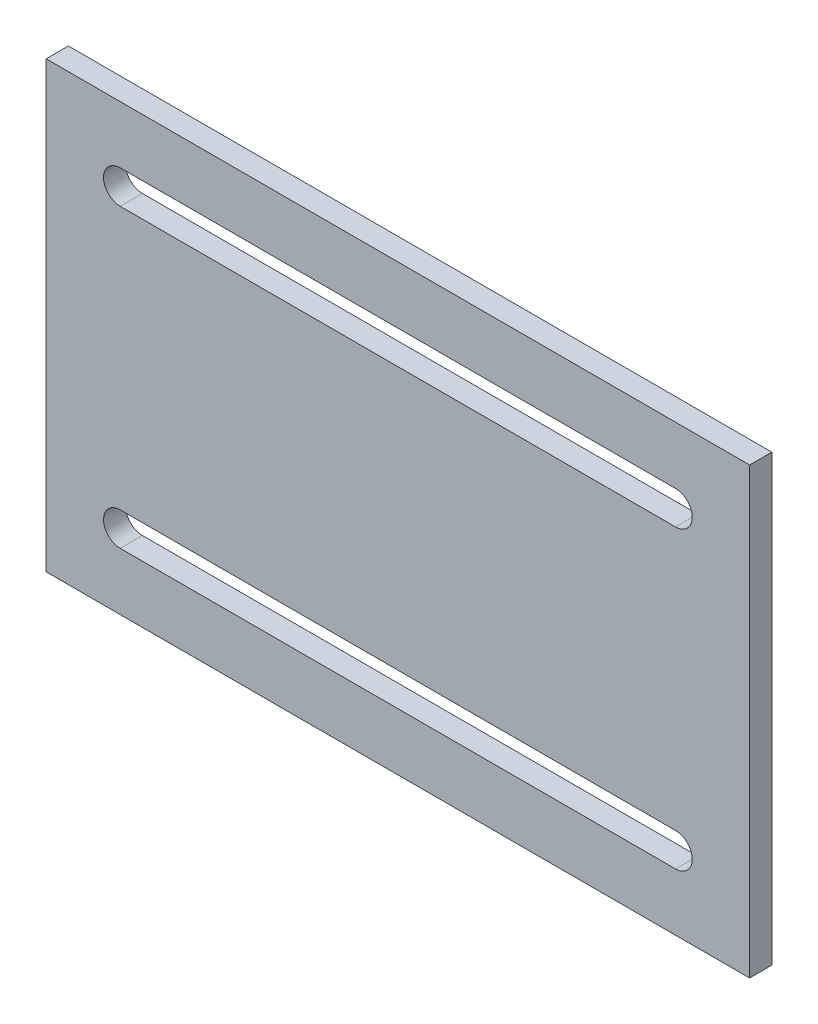
ISO-10303-21;
HEADER;
FILE_DESCRIPTION(('STEP AP214'),'2;1');
FILE_NAME('part.step','',(''),(''),'','','');
FILE_SCHEMA(('AUTOMOTIVE_DESIGN { 1 0 10303 214 1 1 1 1 }'));
ENDSEC;
DATA;
#1=APPLICATION_CONTEXT('core data for automotive mechanical design processes');
#2=APPLICATION_PROTOCOL_DEFINITION('international standard','automotive_design',2000,#1);
#3=PRODUCT_CONTEXT('',#1,'mechanical');
#4=PRODUCT('Part','Part','',(#3));
#5=PRODUCT_RELATED_PRODUCT_CATEGORY('part','',(#4));
#6=PRODUCT_DEFINITION_FORMATION('','',#4);
#7=PRODUCT_DEFINITION_CONTEXT('part definition',#1,'design');
#8=PRODUCT_DEFINITION('design','',#6,#7);
#9=PRODUCT_DEFINITION_SHAPE('','',#8);
#10=(LENGTH_UNIT() NAMED_UNIT(*) SI_UNIT(.MILLI.,.METRE.));
#11=(NAMED_UNIT(*) PLANE_ANGLE_UNIT() SI_UNIT($,.RADIAN.));
#12=(NAMED_UNIT(*) SI_UNIT($,.STERADIAN.) SOLID_ANGLE_UNIT());
#13=UNCERTAINTY_MEASURE_WITH_UNIT(LENGTH_MEASURE(1.E-05),#10,'distance_accuracy_value','');
#14=(GEOMETRIC_REPRESENTATION_CONTEXT(3) GLOBAL_UNCERTAINTY_ASSIGNED_CONTEXT((#13)) GLOBAL_UNIT_ASSIGNED_CONTEXT((#10,
#11,#12)) REPRESENTATION_CONTEXT('',''));
#15=CARTESIAN_POINT('',(0.,0.,0.));
#16=DIRECTION('',(0.,0.,1.));
#17=DIRECTION('',(1.,0.,0.));
#18=AXIS2_PLACEMENT_3D('',#15,#16,#17);
#19=CARTESIAN_POINT('',(0.,0.,12.));
#20=DIRECTION('',(0.,0.,-1.));
#21=DIRECTION('',(-1.,0.,0.));
#22=AXIS2_PLACEMENT_3D('',#19,#20,#21);
#23=PLANE('',#22);
#24=CARTESIAN_POINT('',(-150.,80.,12.));
#25=DIRECTION('',(0.,0.,1.));
#26=DIRECTION('',(1.,0.,0.));
#27=AXIS2_PLACEMENT_3D('',#24,#25,#26);
#28=CIRCLE('',#27,8.99999999999999);
#29=CARTESIAN_POINT('',(-150.,89.,12.));
#30=VERTEX_POINT('',#29);
#31=CARTESIAN_POINT('',(-150.,71.,12.));
#32=VERTEX_POINT('',#31);
#33=EDGE_CURVE('E159',#30,#32,#28,.T.);
#34=ORIENTED_EDGE('',*,*,#33,.F.);
#35=DIRECTION('',(-1.,0.,0.));
#36=VECTOR('',#35,1.);
#37=CARTESIAN_POINT('',(-150.,89.,12.));
#38=LINE('',#37,#36);
#39=CARTESIAN_POINT('',(150.,89.,12.));
#40=VERTEX_POINT('',#39);
#41=EDGE_CURVE('E167',#40,#30,#38,.T.);
#42=ORIENTED_EDGE('',*,*,#41,.F.);
#43=CARTESIAN_POINT('',(150.,80.,12.));
#44=DIRECTION('',(0.,0.,1.));
#45=DIRECTION('',(1.,0.,0.));
#46=AXIS2_PLACEMENT_3D('',#43,#44,#45);
#47=CIRCLE('',#46,8.99999999999999);
#48=CARTESIAN_POINT('',(150.,71.,12.));
#49=VERTEX_POINT('',#48);
#50=EDGE_CURVE('E164',#49,#40,#47,.T.);
#51=ORIENTED_EDGE('',*,*,#50,.F.);
#52=DIRECTION('',(1.,0.,0.));
#53=VECTOR('',#52,1.);
#54=CARTESIAN_POINT('',(-150.,71.,12.));
#55=LINE('',#54,#53);
#56=EDGE_CURVE('E161',#32,#49,#55,.T.);
#57=ORIENTED_EDGE('',*,*,#56,.F.);
#58=EDGE_LOOP('',(#34,#42,#51,#57));
#59=FACE_BOUND('',#58,.T.);
#60=DIRECTION('',(0.,-1.,0.));
#61=VECTOR('',#60,1.);
#62=CARTESIAN_POINT('',(-190.,-120.,12.));
#63=LINE('',#62,#61);
#64=CARTESIAN_POINT('',(-190.,120.,12.));
#65=VERTEX_POINT('',#64);
#66=CARTESIAN_POINT('',(-190.,-120.,12.));
#67=VERTEX_POINT('',#66);
#68=EDGE_CURVE('E190',#65,#67,#63,.T.);
#69=ORIENTED_EDGE('',*,*,#68,.T.);
#70=DIRECTION('',(1.,0.,0.));
#71=VECTOR('',#70,1.);
#72=CARTESIAN_POINT('',(-190.,-120.,12.));
#73=LINE('',#72,#71);
#74=CARTESIAN_POINT('',(190.,-120.,12.));
#75=VERTEX_POINT('',#74);
#76=EDGE_CURVE('E193',#67,#75,#73,.T.);
#77=ORIENTED_EDGE('',*,*,#76,.T.);
#78=DIRECTION('',(0.,1.,0.));
#79=VECTOR('',#78,1.);
#80=CARTESIAN_POINT('',(190.,-120.,12.));
#81=LINE('',#80,#79);
#82=CARTESIAN_POINT('',(190.,120.,12.));
#83=VERTEX_POINT('',#82);
#84=EDGE_CURVE('E196',#75,#83,#81,.T.);
#85=ORIENTED_EDGE('',*,*,#84,.T.);
#86=DIRECTION('',(-1.,0.,0.));
#87=VECTOR('',#86,1.);
#88=CARTESIAN_POINT('',(-190.,120.,12.));
#89=LINE('',#88,#87);
#90=EDGE_CURVE('E198',#83,#65,#89,.T.);
#91=ORIENTED_EDGE('',*,*,#90,.T.);
#92=EDGE_LOOP('',(#69,#77,#85,#91));
#93=FACE_BOUND('',#92,.T.);
#94=CARTESIAN_POINT('',(-150.,-80.0000000000001,12.));
#95=DIRECTION('',(0.,0.,1.));
#96=DIRECTION('',(-1.,0.,0.));
#97=AXIS2_PLACEMENT_3D('',#94,#95,#96);
#98=CIRCLE('',#97,8.99999999999999);
#99=CARTESIAN_POINT('',(-150.,-71.0000000000001,12.));
#100=VERTEX_POINT('',#99);
#101=CARTESIAN_POINT('',(-150.,-89.0000000000001,12.));
#102=VERTEX_POINT('',#101);
#103=EDGE_CURVE('E123',#100,#102,#98,.T.);
#104=ORIENTED_EDGE('',*,*,#103,.F.);
#105=DIRECTION('',(-1.,0.,0.));
#106=VECTOR('',#105,1.);
#107=CARTESIAN_POINT('',(-150.,-71.0000000000001,12.));
#108=LINE('',#107,#106);
#109=CARTESIAN_POINT('',(150.,-71.0000000000001,12.));
#110=VERTEX_POINT('',#109);
#111=EDGE_CURVE('E145',#110,#100,#108,.T.);
#112=ORIENTED_EDGE('',*,*,#111,.F.);
#113=CARTESIAN_POINT('',(150.,-80.0000000000001,12.));
#114=DIRECTION('',(0.,0.,1.));
#115=DIRECTION('',(-1.,0.,0.));
#116=AXIS2_PLACEMENT_3D('',#113,#114,#115);
#117=CIRCLE('',#116,8.99999999999999);
#118=CARTESIAN_POINT('',(150.,-89.0000000000001,12.));
#119=VERTEX_POINT('',#118);
#120=EDGE_CURVE('E143',#119,#110,#117,.T.);
#121=ORIENTED_EDGE('',*,*,#120,.F.);
#122=DIRECTION('',(1.,0.,0.));
#123=VECTOR('',#122,1.);
#124=CARTESIAN_POINT('',(-150.,-89.0000000000001,12.));
#125=LINE('',#124,#123);
#126=EDGE_CURVE('E131',#102,#119,#125,.T.);
#127=ORIENTED_EDGE('',*,*,#126,.F.);
#128=EDGE_LOOP('',(#104,#112,#121,#127));
#129=FACE_BOUND('',#128,.T.);
#130=ADVANCED_FACE('F34',(#59,#93,#129),#23,.F.);
#131=CARTESIAN_POINT('',(0.,0.,0.));
#132=DIRECTION('',(0.,0.,-1.));
#133=DIRECTION('',(-1.,0.,0.));
#134=AXIS2_PLACEMENT_3D('',#131,#132,#133);
#135=PLANE('',#134);
#136=DIRECTION('',(-1.,0.,0.));
#137=VECTOR('',#136,1.);
#138=CARTESIAN_POINT('',(-150.,89.,0.));
#139=LINE('',#138,#137);
#140=CARTESIAN_POINT('',(150.,89.,0.));
#141=VERTEX_POINT('',#140);
#142=CARTESIAN_POINT('',(-150.,89.,0.));
#143=VERTEX_POINT('',#142);
#144=EDGE_CURVE('E162',#141,#143,#139,.T.);
#145=ORIENTED_EDGE('',*,*,#144,.T.);
#146=CARTESIAN_POINT('',(-150.,80.,0.));
#147=DIRECTION('',(0.,0.,1.));
#148=DIRECTION('',(1.,0.,0.));
#149=AXIS2_PLACEMENT_3D('',#146,#147,#148);
#150=CIRCLE('',#149,8.99999999999999);
#151=CARTESIAN_POINT('',(-150.,71.,0.));
#152=VERTEX_POINT('',#151);
#153=EDGE_CURVE('E139',#143,#152,#150,.T.);
#154=ORIENTED_EDGE('',*,*,#153,.T.);
#155=DIRECTION('',(1.,0.,0.));
#156=VECTOR('',#155,1.);
#157=CARTESIAN_POINT('',(-150.,71.,0.));
#158=LINE('',#157,#156);
#159=CARTESIAN_POINT('',(150.,71.,0.));
#160=VERTEX_POINT('',#159);
#161=EDGE_CURVE('E172',#152,#160,#158,.T.);
#162=ORIENTED_EDGE('',*,*,#161,.T.);
#163=CARTESIAN_POINT('',(150.,80.,0.));
#164=DIRECTION('',(0.,0.,1.));
#165=DIRECTION('',(1.,0.,0.));
#166=AXIS2_PLACEMENT_3D('',#163,#164,#165);
#167=CIRCLE('',#166,8.99999999999999);
#168=EDGE_CURVE('E175',#160,#141,#167,.T.);
#169=ORIENTED_EDGE('',*,*,#168,.T.);
#170=EDGE_LOOP('',(#145,#154,#162,#169));
#171=FACE_BOUND('',#170,.T.);
#172=DIRECTION('',(0.,-1.,0.));
#173=VECTOR('',#172,1.);
#174=CARTESIAN_POINT('',(-190.,-120.,0.));
#175=LINE('',#174,#173);
#176=CARTESIAN_POINT('',(-190.,120.,0.));
#177=VERTEX_POINT('',#176);
#178=CARTESIAN_POINT('',(-190.,-120.,0.));
#179=VERTEX_POINT('',#178);
#180=EDGE_CURVE('E189',#177,#179,#175,.T.);
#181=ORIENTED_EDGE('',*,*,#180,.F.);
#182=DIRECTION('',(-1.,0.,0.));
#183=VECTOR('',#182,1.);
#184=CARTESIAN_POINT('',(-190.,120.,0.));
#185=LINE('',#184,#183);
#186=CARTESIAN_POINT('',(190.,120.,0.));
#187=VERTEX_POINT('',#186);
#188=EDGE_CURVE('E194',#187,#177,#185,.T.);
#189=ORIENTED_EDGE('',*,*,#188,.F.);
#190=DIRECTION('',(0.,1.,0.));
#191=VECTOR('',#190,1.);
#192=CARTESIAN_POINT('',(190.,-120.,0.));
#193=LINE('',#192,#191);
#194=CARTESIAN_POINT('',(190.,-120.,0.));
#195=VERTEX_POINT('',#194);
#196=EDGE_CURVE('E205',#195,#187,#193,.T.);
#197=ORIENTED_EDGE('',*,*,#196,.F.);
#198=DIRECTION('',(1.,0.,0.));
#199=VECTOR('',#198,1.);
#200=CARTESIAN_POINT('',(-190.,-120.,0.));
#201=LINE('',#200,#199);
#202=EDGE_CURVE('E203',#179,#195,#201,.T.);
#203=ORIENTED_EDGE('',*,*,#202,.F.);
#204=EDGE_LOOP('',(#181,#189,#197,#203));
#205=FACE_BOUND('',#204,.T.);
#206=DIRECTION('',(-1.,0.,0.));
#207=VECTOR('',#206,1.);
#208=CARTESIAN_POINT('',(-150.,-71.0000000000001,0.));
#209=LINE('',#208,#207);
#210=CARTESIAN_POINT('',(150.,-71.0000000000001,0.));
#211=VERTEX_POINT('',#210);
#212=CARTESIAN_POINT('',(-150.,-71.0000000000001,0.));
#213=VERTEX_POINT('',#212);
#214=EDGE_CURVE('E132',#211,#213,#209,.T.);
#215=ORIENTED_EDGE('',*,*,#214,.T.);
#216=CARTESIAN_POINT('',(-150.,-80.0000000000001,0.));
#217=DIRECTION('',(0.,0.,1.));
#218=DIRECTION('',(-1.,0.,0.));
#219=AXIS2_PLACEMENT_3D('',#216,#217,#218);
#220=CIRCLE('',#219,8.99999999999999);
#221=CARTESIAN_POINT('',(-150.,-89.0000000000001,0.));
#222=VERTEX_POINT('',#221);
#223=EDGE_CURVE('E57',#213,#222,#220,.T.);
#224=ORIENTED_EDGE('',*,*,#223,.T.);
#225=DIRECTION('',(1.,0.,0.));
#226=VECTOR('',#225,1.);
#227=CARTESIAN_POINT('',(-150.,-89.0000000000001,0.));
#228=LINE('',#227,#226);
#229=CARTESIAN_POINT('',(150.,-89.0000000000001,0.));
#230=VERTEX_POINT('',#229);
#231=EDGE_CURVE('E138',#222,#230,#228,.T.);
#232=ORIENTED_EDGE('',*,*,#231,.T.);
#233=CARTESIAN_POINT('',(150.,-80.0000000000001,0.));
#234=DIRECTION('',(0.,0.,1.));
#235=DIRECTION('',(-1.,0.,0.));
#236=AXIS2_PLACEMENT_3D('',#233,#234,#235);
#237=CIRCLE('',#236,8.99999999999999);
#238=EDGE_CURVE('E151',#230,#211,#237,.T.);
#239=ORIENTED_EDGE('',*,*,#238,.T.);
#240=EDGE_LOOP('',(#215,#224,#232,#239));
#241=FACE_BOUND('',#240,.T.);
#242=ADVANCED_FACE('F223',(#171,#205,#241),#135,.T.);
#243=CARTESIAN_POINT('',(-190.,-120.,12.));
#244=DIRECTION('',(1.,0.,0.));
#245=DIRECTION('',(0.,0.,-1.));
#246=AXIS2_PLACEMENT_3D('',#243,#244,#245);
#247=PLANE('',#246);
#248=ORIENTED_EDGE('',*,*,#180,.T.);
#249=DIRECTION('',(0.,0.,-1.));
#250=VECTOR('',#249,1.);
#251=CARTESIAN_POINT('',(-190.,-120.,12.));
#252=LINE('',#251,#250);
#253=EDGE_CURVE('E11',#67,#179,#252,.T.);
#254=ORIENTED_EDGE('',*,*,#253,.F.);
#255=ORIENTED_EDGE('',*,*,#68,.F.);
#256=DIRECTION('',(0.,0.,-1.));
#257=VECTOR('',#256,1.);
#258=CARTESIAN_POINT('',(-190.,120.,12.));
#259=LINE('',#258,#257);
#260=EDGE_CURVE('E200',#65,#177,#259,.T.);
#261=ORIENTED_EDGE('',*,*,#260,.T.);
#262=EDGE_LOOP('',(#248,#254,#255,#261));
#263=FACE_BOUND('',#262,.T.);
#264=ADVANCED_FACE('F36',(#263),#247,.F.);
#265=CARTESIAN_POINT('',(-190.,-120.,12.));
#266=DIRECTION('',(0.,1.,0.));
#267=DIRECTION('',(0.,0.,1.));
#268=AXIS2_PLACEMENT_3D('',#265,#266,#267);
#269=PLANE('',#268);
#270=ORIENTED_EDGE('',*,*,#202,.T.);
#271=DIRECTION('',(0.,0.,-1.));
#272=VECTOR('',#271,1.);
#273=CARTESIAN_POINT('',(190.,-120.,12.));
#274=LINE('',#273,#272);
#275=EDGE_CURVE('E42',#75,#195,#274,.T.);
#276=ORIENTED_EDGE('',*,*,#275,.F.);
#277=ORIENTED_EDGE('',*,*,#76,.F.);
#278=ORIENTED_EDGE('',*,*,#253,.T.);
#279=EDGE_LOOP('',(#270,#276,#277,#278));
#280=FACE_BOUND('',#279,.T.);
#281=ADVANCED_FACE('F233',(#280),#269,.F.);
#282=CARTESIAN_POINT('',(190.,-120.,12.));
#283=DIRECTION('',(-1.,0.,0.));
#284=DIRECTION('',(0.,-1.,0.));
#285=AXIS2_PLACEMENT_3D('',#282,#283,#284);
#286=PLANE('',#285);
#287=ORIENTED_EDGE('',*,*,#196,.T.);
#288=DIRECTION('',(0.,0.,-1.));
#289=VECTOR('',#288,1.);
#290=CARTESIAN_POINT('',(190.,120.,12.));
#291=LINE('',#290,#289);
#292=EDGE_CURVE('E210',#83,#187,#291,.T.);
#293=ORIENTED_EDGE('',*,*,#292,.F.);
#294=ORIENTED_EDGE('',*,*,#84,.F.);
#295=ORIENTED_EDGE('',*,*,#275,.T.);
#296=EDGE_LOOP('',(#287,#293,#294,#295));
#297=FACE_BOUND('',#296,.T.);
#298=ADVANCED_FACE('F217',(#297),#286,.F.);
#299=CARTESIAN_POINT('',(-190.,120.,12.));
#300=DIRECTION('',(0.,-1.,0.));
#301=DIRECTION('',(1.,0.,0.));
#302=AXIS2_PLACEMENT_3D('',#299,#300,#301);
#303=PLANE('',#302);
#304=ORIENTED_EDGE('',*,*,#188,.T.);
#305=ORIENTED_EDGE('',*,*,#260,.F.);
#306=ORIENTED_EDGE('',*,*,#90,.F.);
#307=ORIENTED_EDGE('',*,*,#292,.T.);
#308=EDGE_LOOP('',(#304,#305,#306,#307));
#309=FACE_BOUND('',#308,.T.);
#310=ADVANCED_FACE('F227',(#309),#303,.F.);
#311=CARTESIAN_POINT('',(-150.,80.,12.));
#312=DIRECTION('',(0.,0.,-1.));
#313=DIRECTION('',(-1.,0.,0.));
#314=AXIS2_PLACEMENT_3D('',#311,#312,#313);
#315=CYLINDRICAL_SURFACE('',#314,8.99999999999999);
#316=ORIENTED_EDGE('',*,*,#153,.F.);
#317=DIRECTION('',(0.,0.,-1.));
#318=VECTOR('',#317,1.);
#319=CARTESIAN_POINT('',(-150.,89.,12.));
#320=LINE('',#319,#318);
#321=EDGE_CURVE('E169',#30,#143,#320,.T.);
#322=ORIENTED_EDGE('',*,*,#321,.F.);
#323=ORIENTED_EDGE('',*,*,#33,.T.);
#324=DIRECTION('',(0.,0.,-1.));
#325=VECTOR('',#324,1.);
#326=CARTESIAN_POINT('',(-150.,71.,12.));
#327=LINE('',#326,#325);
#328=EDGE_CURVE('E186',#32,#152,#327,.T.);
#329=ORIENTED_EDGE('',*,*,#328,.T.);
#330=EDGE_LOOP('',(#316,#322,#323,#329));
#331=FACE_BOUND('',#330,.T.);
#332=ADVANCED_FACE('F250',(#331),#315,.F.);
#333=CARTESIAN_POINT('',(-150.,71.,12.));
#334=DIRECTION('',(0.,1.,0.));
#335=DIRECTION('',(0.,0.,1.));
#336=AXIS2_PLACEMENT_3D('',#333,#334,#335);
#337=PLANE('',#336);
#338=ORIENTED_EDGE('',*,*,#161,.F.);
#339=ORIENTED_EDGE('',*,*,#328,.F.);
#340=ORIENTED_EDGE('',*,*,#56,.T.);
#341=DIRECTION('',(0.,0.,-1.));
#342=VECTOR('',#341,1.);
#343=CARTESIAN_POINT('',(150.,71.,12.));
#344=LINE('',#343,#342);
#345=EDGE_CURVE('E184',#49,#160,#344,.T.);
#346=ORIENTED_EDGE('',*,*,#345,.T.);
#347=EDGE_LOOP('',(#338,#339,#340,#346));
#348=FACE_BOUND('',#347,.T.);
#349=ADVANCED_FACE('F257',(#348),#337,.T.);
#350=CARTESIAN_POINT('',(150.,80.,12.));
#351=DIRECTION('',(0.,0.,-1.));
#352=DIRECTION('',(-1.,0.,0.));
#353=AXIS2_PLACEMENT_3D('',#350,#351,#352);
#354=CYLINDRICAL_SURFACE('',#353,8.99999999999999);
#355=ORIENTED_EDGE('',*,*,#168,.F.);
#356=ORIENTED_EDGE('',*,*,#345,.F.);
#357=ORIENTED_EDGE('',*,*,#50,.T.);
#358=DIRECTION('',(0.,0.,-1.));
#359=VECTOR('',#358,1.);
#360=CARTESIAN_POINT('',(150.,89.,12.));
#361=LINE('',#360,#359);
#362=EDGE_CURVE('E182',#40,#141,#361,.T.);
#363=ORIENTED_EDGE('',*,*,#362,.T.);
#364=EDGE_LOOP('',(#355,#356,#357,#363));
#365=FACE_BOUND('',#364,.T.);
#366=ADVANCED_FACE('F262',(#365),#354,.F.);
#367=CARTESIAN_POINT('',(-150.,89.,12.));
#368=DIRECTION('',(0.,-1.,0.));
#369=DIRECTION('',(0.,0.,-1.));
#370=AXIS2_PLACEMENT_3D('',#367,#368,#369);
#371=PLANE('',#370);
#372=ORIENTED_EDGE('',*,*,#144,.F.);
#373=ORIENTED_EDGE('',*,*,#362,.F.);
#374=ORIENTED_EDGE('',*,*,#41,.T.);
#375=ORIENTED_EDGE('',*,*,#321,.T.);
#376=EDGE_LOOP('',(#372,#373,#374,#375));
#377=FACE_BOUND('',#376,.T.);
#378=ADVANCED_FACE('F268',(#377),#371,.T.);
#379=CARTESIAN_POINT('',(-150.,-80.0000000000001,12.));
#380=DIRECTION('',(0.,0.,-1.));
#381=DIRECTION('',(-1.,0.,0.));
#382=AXIS2_PLACEMENT_3D('',#379,#380,#381);
#383=CYLINDRICAL_SURFACE('',#382,8.99999999999999);
#384=ORIENTED_EDGE('',*,*,#223,.F.);
#385=DIRECTION('',(0.,0.,-1.));
#386=VECTOR('',#385,1.);
#387=CARTESIAN_POINT('',(-150.,-71.0000000000001,12.));
#388=LINE('',#387,#386);
#389=EDGE_CURVE('E127',#100,#213,#388,.T.);
#390=ORIENTED_EDGE('',*,*,#389,.F.);
#391=ORIENTED_EDGE('',*,*,#103,.T.);
#392=DIRECTION('',(0.,0.,-1.));
#393=VECTOR('',#392,1.);
#394=CARTESIAN_POINT('',(-150.,-89.0000000000001,12.));
#395=LINE('',#394,#393);
#396=EDGE_CURVE('E126',#102,#222,#395,.T.);
#397=ORIENTED_EDGE('',*,*,#396,.T.);
#398=EDGE_LOOP('',(#384,#390,#391,#397));
#399=FACE_BOUND('',#398,.T.);
#400=ADVANCED_FACE('F125',(#399),#383,.F.);
#401=CARTESIAN_POINT('',(-150.,-89.0000000000001,12.));
#402=DIRECTION('',(0.,1.,0.));
#403=DIRECTION('',(0.,0.,1.));
#404=AXIS2_PLACEMENT_3D('',#401,#402,#403);
#405=PLANE('',#404);
#406=ORIENTED_EDGE('',*,*,#231,.F.);
#407=ORIENTED_EDGE('',*,*,#396,.F.);
#408=ORIENTED_EDGE('',*,*,#126,.T.);
#409=DIRECTION('',(0.,0.,-1.));
#410=VECTOR('',#409,1.);
#411=CARTESIAN_POINT('',(150.,-89.0000000000001,12.));
#412=LINE('',#411,#410);
#413=EDGE_CURVE('E140',#119,#230,#412,.T.);
#414=ORIENTED_EDGE('',*,*,#413,.T.);
#415=EDGE_LOOP('',(#406,#407,#408,#414));
#416=FACE_BOUND('',#415,.T.);
#417=ADVANCED_FACE('F135',(#416),#405,.T.);
#418=CARTESIAN_POINT('',(150.,-80.0000000000001,12.));
#419=DIRECTION('',(0.,0.,-1.));
#420=DIRECTION('',(-1.,0.,0.));
#421=AXIS2_PLACEMENT_3D('',#418,#419,#420);
#422=CYLINDRICAL_SURFACE('',#421,8.99999999999999);
#423=ORIENTED_EDGE('',*,*,#238,.F.);
#424=ORIENTED_EDGE('',*,*,#413,.F.);
#425=ORIENTED_EDGE('',*,*,#120,.T.);
#426=DIRECTION('',(0.,0.,-1.));
#427=VECTOR('',#426,1.);
#428=CARTESIAN_POINT('',(150.,-71.0000000000001,12.));
#429=LINE('',#428,#427);
#430=EDGE_CURVE('E49',#110,#211,#429,.T.);
#431=ORIENTED_EDGE('',*,*,#430,.T.);
#432=EDGE_LOOP('',(#423,#424,#425,#431));
#433=FACE_BOUND('',#432,.T.);
#434=ADVANCED_FACE('F286',(#433),#422,.F.);
#435=CARTESIAN_POINT('',(-150.,-71.0000000000001,12.));
#436=DIRECTION('',(0.,-1.,0.));
#437=DIRECTION('',(0.,0.,-1.));
#438=AXIS2_PLACEMENT_3D('',#435,#436,#437);
#439=PLANE('',#438);
#440=ORIENTED_EDGE('',*,*,#214,.F.);
#441=ORIENTED_EDGE('',*,*,#430,.F.);
#442=ORIENTED_EDGE('',*,*,#111,.T.);
#443=ORIENTED_EDGE('',*,*,#389,.T.);
#444=EDGE_LOOP('',(#440,#441,#442,#443));
#445=FACE_BOUND('',#444,.T.);
#446=ADVANCED_FACE('F289',(#445),#439,.T.);
#447=CLOSED_SHELL('',(#130,#242,#264,#281,#298,#310,#332,#349,#366,#378,#400,#417,#434,#446));
#448=MANIFOLD_SOLID_BREP('B2',#447);
#449=ADVANCED_BREP_SHAPE_REPRESENTATION('',(#18,#448),#14);
#450=SHAPE_DEFINITION_REPRESENTATION(#9,#449);
ENDSEC;
END-ISO-10303-21;
